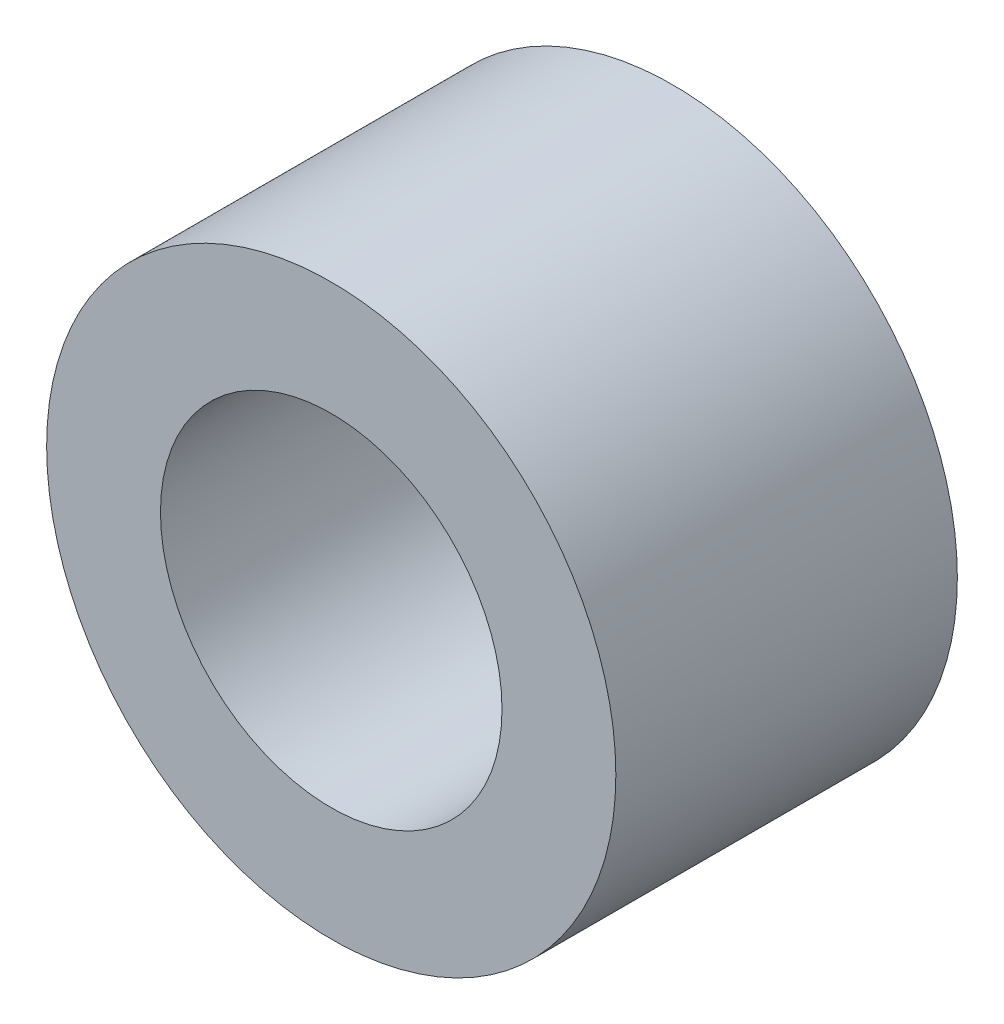
ISO-10303-21;
HEADER;
FILE_DESCRIPTION(('STEP AP214'),'2;1');
FILE_NAME('part.step','',(''),(''),'','','');
FILE_SCHEMA(('AUTOMOTIVE_DESIGN { 1 0 10303 214 1 1 1 1 }'));
ENDSEC;
DATA;
#1=APPLICATION_CONTEXT('core data for automotive mechanical design processes');
#2=APPLICATION_PROTOCOL_DEFINITION('international standard','automotive_design',2000,#1);
#3=PRODUCT_CONTEXT('',#1,'mechanical');
#4=PRODUCT('Part','Part','',(#3));
#5=PRODUCT_RELATED_PRODUCT_CATEGORY('part','',(#4));
#6=PRODUCT_DEFINITION_FORMATION('','',#4);
#7=PRODUCT_DEFINITION_CONTEXT('part definition',#1,'design');
#8=PRODUCT_DEFINITION('design','',#6,#7);
#9=PRODUCT_DEFINITION_SHAPE('','',#8);
#10=(LENGTH_UNIT() NAMED_UNIT(*) SI_UNIT(.MILLI.,.METRE.));
#11=(NAMED_UNIT(*) PLANE_ANGLE_UNIT() SI_UNIT($,.RADIAN.));
#12=(NAMED_UNIT(*) SI_UNIT($,.STERADIAN.) SOLID_ANGLE_UNIT());
#13=UNCERTAINTY_MEASURE_WITH_UNIT(LENGTH_MEASURE(1.E-05),#10,'distance_accuracy_value','');
#14=(GEOMETRIC_REPRESENTATION_CONTEXT(3) GLOBAL_UNCERTAINTY_ASSIGNED_CONTEXT((#13)) GLOBAL_UNIT_ASSIGNED_CONTEXT((#10,
#11,#12)) REPRESENTATION_CONTEXT('',''));
#15=CARTESIAN_POINT('',(0.,0.,0.));
#16=DIRECTION('',(0.,0.,1.));
#17=DIRECTION('',(1.,0.,0.));
#18=AXIS2_PLACEMENT_3D('',#15,#16,#17);
#19=CARTESIAN_POINT('',(0.,0.,15.));
#20=DIRECTION('',(0.,0.,-1.));
#21=DIRECTION('',(-1.,0.,0.));
#22=AXIS2_PLACEMENT_3D('',#19,#20,#21);
#23=CYLINDRICAL_SURFACE('',#22,25.);
#24=CARTESIAN_POINT('',(0.,0.,15.));
#25=DIRECTION('',(0.,0.,1.));
#26=DIRECTION('',(1.,0.,0.));
#27=AXIS2_PLACEMENT_3D('',#24,#25,#26);
#28=CIRCLE('',#27,25.);
#29=CARTESIAN_POINT('',(25.,0.,15.));
#30=VERTEX_POINT('',#29);
#31=EDGE_CURVE('E10',#30,#30,#28,.T.);
#32=ORIENTED_EDGE('',*,*,#31,.F.);
#33=EDGE_LOOP('',(#32));
#34=FACE_BOUND('',#33,.T.);
#35=CARTESIAN_POINT('',(0.,0.,-15.));
#36=DIRECTION('',(0.,0.,1.));
#37=DIRECTION('',(1.,0.,0.));
#38=AXIS2_PLACEMENT_3D('',#35,#36,#37);
#39=CIRCLE('',#38,25.);
#40=CARTESIAN_POINT('',(25.,0.,-15.));
#41=VERTEX_POINT('',#40);
#42=EDGE_CURVE('E45',#41,#41,#39,.T.);
#43=ORIENTED_EDGE('',*,*,#42,.T.);
#44=EDGE_LOOP('',(#43));
#45=FACE_BOUND('',#44,.T.);
#46=ADVANCED_FACE('F37',(#34,#45),#23,.T.);
#47=CARTESIAN_POINT('',(0.,0.,15.));
#48=DIRECTION('',(0.,0.,1.));
#49=DIRECTION('',(1.,0.,0.));
#50=AXIS2_PLACEMENT_3D('',#47,#48,#49);
#51=PLANE('',#50);
#52=CARTESIAN_POINT('',(0.,0.,15.));
#53=DIRECTION('',(0.,0.,1.));
#54=DIRECTION('',(1.,0.,0.));
#55=AXIS2_PLACEMENT_3D('',#52,#53,#54);
#56=CIRCLE('',#55,15.);
#57=CARTESIAN_POINT('',(15.,0.,15.));
#58=VERTEX_POINT('',#57);
#59=EDGE_CURVE('E51',#58,#58,#56,.F.);
#60=ORIENTED_EDGE('',*,*,#59,.T.);
#61=EDGE_LOOP('',(#60));
#62=FACE_BOUND('',#61,.T.);
#63=ORIENTED_EDGE('',*,*,#31,.T.);
#64=EDGE_LOOP('',(#63));
#65=FACE_BOUND('',#64,.T.);
#66=ADVANCED_FACE('F66',(#62,#65),#51,.T.);
#67=CARTESIAN_POINT('',(0.,0.,-15.));
#68=DIRECTION('',(0.,0.,1.));
#69=DIRECTION('',(1.,0.,0.));
#70=AXIS2_PLACEMENT_3D('',#67,#68,#69);
#71=PLANE('',#70);
#72=CARTESIAN_POINT('',(0.,0.,-15.));
#73=DIRECTION('',(0.,0.,1.));
#74=DIRECTION('',(1.,0.,0.));
#75=AXIS2_PLACEMENT_3D('',#72,#73,#74);
#76=CIRCLE('',#75,15.);
#77=CARTESIAN_POINT('',(15.,0.,-15.));
#78=VERTEX_POINT('',#77);
#79=EDGE_CURVE('E40',#78,#78,#76,.F.);
#80=ORIENTED_EDGE('',*,*,#79,.F.);
#81=EDGE_LOOP('',(#80));
#82=FACE_BOUND('',#81,.T.);
#83=ORIENTED_EDGE('',*,*,#42,.F.);
#84=EDGE_LOOP('',(#83));
#85=FACE_BOUND('',#84,.T.);
#86=ADVANCED_FACE('F63',(#82,#85),#71,.F.);
#87=CARTESIAN_POINT('',(0.,0.,125.));
#88=DIRECTION('',(0.,0.,-1.));
#89=DIRECTION('',(-1.,0.,0.));
#90=AXIS2_PLACEMENT_3D('',#87,#88,#89);
#91=CYLINDRICAL_SURFACE('',#90,15.);
#92=ORIENTED_EDGE('',*,*,#59,.F.);
#93=EDGE_LOOP('',(#92));
#94=FACE_BOUND('',#93,.T.);
#95=ORIENTED_EDGE('',*,*,#79,.T.);
#96=EDGE_LOOP('',(#95));
#97=FACE_BOUND('',#96,.T.);
#98=ADVANCED_FACE('F61',(#94,#97),#91,.F.);
#99=CLOSED_SHELL('',(#46,#66,#86,#98));
#100=MANIFOLD_SOLID_BREP('B2',#99);
#101=ADVANCED_BREP_SHAPE_REPRESENTATION('',(#18,#100),#14);
#102=SHAPE_DEFINITION_REPRESENTATION(#9,#101);
ENDSEC;
END-ISO-10303-21;
